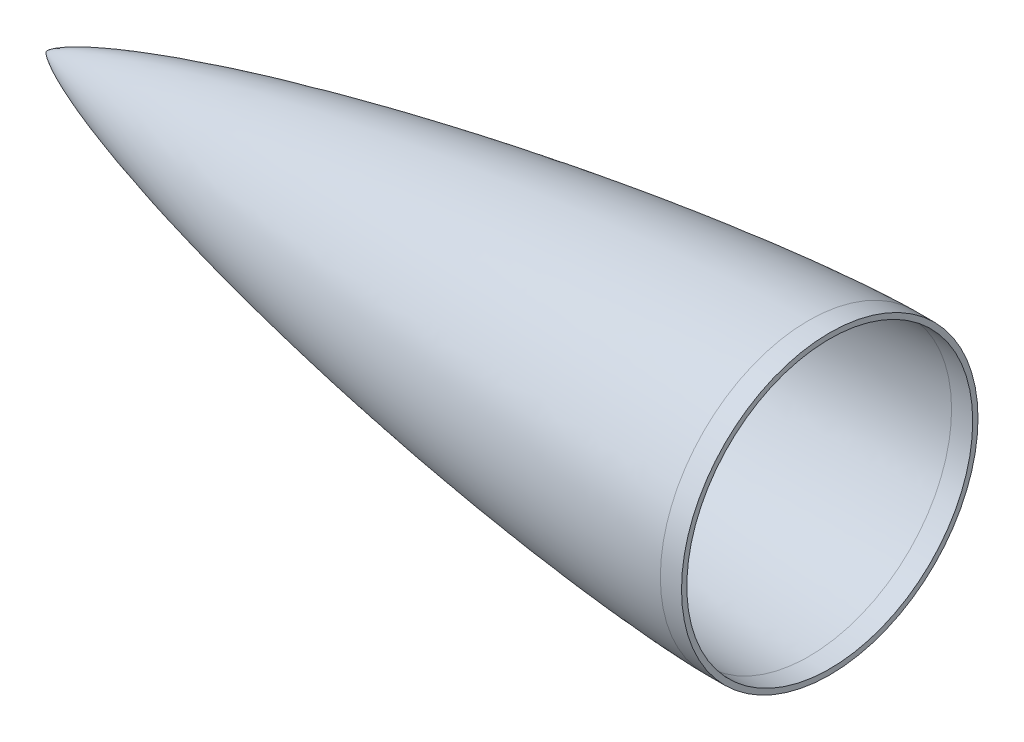
ISO-10303-21;
HEADER;
FILE_DESCRIPTION(('STEP AP214'),'2;1');
FILE_NAME('part.step','',(''),(''),'','','');
FILE_SCHEMA(('AUTOMOTIVE_DESIGN { 1 0 10303 214 1 1 1 1 }'));
ENDSEC;
DATA;
#1=APPLICATION_CONTEXT('core data for automotive mechanical design processes');
#2=APPLICATION_PROTOCOL_DEFINITION('international standard','automotive_design',2000,#1);
#3=PRODUCT_CONTEXT('',#1,'mechanical');
#4=PRODUCT('Part','Part','',(#3));
#5=PRODUCT_RELATED_PRODUCT_CATEGORY('part','',(#4));
#6=PRODUCT_DEFINITION_FORMATION('','',#4);
#7=PRODUCT_DEFINITION_CONTEXT('part definition',#1,'design');
#8=PRODUCT_DEFINITION('design','',#6,#7);
#9=PRODUCT_DEFINITION_SHAPE('','',#8);
#10=(LENGTH_UNIT() NAMED_UNIT(*) SI_UNIT(.MILLI.,.METRE.));
#11=(NAMED_UNIT(*) PLANE_ANGLE_UNIT() SI_UNIT($,.RADIAN.));
#12=(NAMED_UNIT(*) SI_UNIT($,.STERADIAN.) SOLID_ANGLE_UNIT());
#13=UNCERTAINTY_MEASURE_WITH_UNIT(LENGTH_MEASURE(1.E-05),#10,'distance_accuracy_value','');
#14=(GEOMETRIC_REPRESENTATION_CONTEXT(3) GLOBAL_UNCERTAINTY_ASSIGNED_CONTEXT((#13)) GLOBAL_UNIT_ASSIGNED_CONTEXT((#10,
#11,#12)) REPRESENTATION_CONTEXT('',''));
#15=CARTESIAN_POINT('',(0.,0.,0.));
#16=DIRECTION('',(0.,0.,1.));
#17=DIRECTION('',(1.,0.,0.));
#18=AXIS2_PLACEMENT_3D('',#15,#16,#17);
#19=CARTESIAN_POINT('',(457.2,88.9151474306752,0.));
#20=CARTESIAN_POINT('',(455.946325970131,88.9096070595816,0.));
#21=CARTESIAN_POINT('',(453.439259358558,88.8670591141968,0.));
#22=CARTESIAN_POINT('',(448.426238411328,88.7337773947161,0.));
#23=CARTESIAN_POINT('',(439.73839281718,88.3857521285292,0.));
#24=CARTESIAN_POINT('',(428.633298536274,87.7894164542894,0.));
#25=CARTESIAN_POINT('',(411.444893999551,86.6327793707619,0.));
#26=CARTESIAN_POINT('',(389.441443153579,84.7940694843695,0.));
#27=CARTESIAN_POINT('',(363.808737294308,82.2338961157606,0.));
#28=CARTESIAN_POINT('',(334.566457513105,78.8280593272444,0.));
#29=CARTESIAN_POINT('',(305.377643317541,74.992305893388,0.));
#30=CARTESIAN_POINT('',(276.244707872545,70.7535830300126,0.));
#31=CARTESIAN_POINT('',(247.171268660131,66.1243959171367,0.));
#32=CARTESIAN_POINT('',(218.162700889625,61.1047240595085,0.));
#33=CARTESIAN_POINT('',(189.226352810735,55.6834645782928,0.));
#34=CARTESIAN_POINT('',(160.373138085459,49.8354605300759,0.));
#35=CARTESIAN_POINT('',(131.618382458485,43.5190500386218,0.));
#36=CARTESIAN_POINT('',(102.986961257339,36.6637158027097,0.));
#37=CARTESIAN_POINT('',(75.2291315334263,29.34260403624,0.));
#38=CARTESIAN_POINT('',(51.2280847232855,22.2453278220032,0.));
#39=CARTESIAN_POINT('',(32.1609199731866,15.8309473459927,0.));
#40=CARTESIAN_POINT('',(18.8818526621386,10.6607161614939,0.));
#41=CARTESIAN_POINT('',(11.1356400070898,7.19917025164617,0.));
#42=CARTESIAN_POINT('',(6.41553741622741,4.76888097271789,0.));
#43=CARTESIAN_POINT('',(3.70040498934197,3.15649989124108,0.));
#44=CARTESIAN_POINT('',(2.1712436943493,2.11577541374487,0.));
#45=CARTESIAN_POINT('',(1.29726517344645,1.43712408397375,0.));
#46=CARTESIAN_POINT('',(0.796656587163147,0.996403728119644,0.));
#47=CARTESIAN_POINT('',(0.508236086993361,0.709975777371162,0.));
#48=CARTESIAN_POINT('',(0.336940369552542,0.5207345708639,0.));
#49=CARTESIAN_POINT('',(0.219057570584673,0.377905450824387,0.));
#50=CARTESIAN_POINT('',(0.133875618926122,0.263125341051019,0.));
#51=CARTESIAN_POINT('',(0.06950687304492,0.163021890873473,0.));
#52=CARTESIAN_POINT('',(0.025920332395015,0.0786931532777685,0.));
#53=CARTESIAN_POINT('',(0.00817122284619331,0.0346034081490176,0.));
#54=CARTESIAN_POINT('',(0.00225195502300941,0.0116765884656801,0.));
#55=CARTESIAN_POINT('',(0.,0.,0.));
#56=B_SPLINE_CURVE_WITH_KNOTS('',4,(#19,#20,#21,#22,#23,#24,#25,#26,#27,#28,#29,#30,#31,#32,#33,
#34,#35,#36,#37,#38,#39,#40,#41,#42,#43,#44,#45,#46,#47,#48,#49,#50,#51,#52,#53,#54,#55),
.UNSPECIFIED.,.F.,.F.,(5,1,1,1,1,1,1,1,1,1,1,1,1,1,1,1,1,1,1,1,1,1,1,1,1,1,1,1,1,1,1,1,1,5),(0.,
0.0107028585408144,0.0214057170816288,0.0428114341632575,0.0742270157557156,0.105642597348174,
0.168473764273532,0.231304932082114,0.294136099101199,0.356967264511137,0.419798428516133,
0.482629593130158,0.54546076349562,0.608291924387174,0.671123088525779,0.733954252495489,
0.796785426569319,0.859616580073358,0.916172283638337,0.947587760918424,0.968473522471574,
0.981230284106354,0.988574031772078,0.992887341044273,0.995416079253204,0.997012129469831,
0.998014752370499,0.998578001550583,0.998884285300425,0.999190569050268,0.999595284525134,
0.999797642262567,0.999898821131283,1.),.UNSPECIFIED.);
#57=CARTESIAN_POINT('',(457.2,0.,0.));
#58=DIRECTION('',(1.,0.,0.));
#59=AXIS1_PLACEMENT('',#57,#58);
#60=SURFACE_OF_REVOLUTION('',#56,#59);
#61=CARTESIAN_POINT('',(0.,0.,0.));
#62=VERTEX_POINT('',#61);
#63=VERTEX_LOOP('',#62);
#64=FACE_BOUND('',#63,.T.);
#65=CARTESIAN_POINT('',(457.2,0.,0.));
#66=DIRECTION('',(1.,0.,0.));
#67=DIRECTION('',(0.,0.,-1.));
#68=AXIS2_PLACEMENT_3D('',#65,#66,#67);
#69=CIRCLE('',#68,88.9151474306748);
#70=CARTESIAN_POINT('',(457.2,0.,-88.9151474306748));
#71=VERTEX_POINT('',#70);
#72=EDGE_CURVE('E43',#71,#71,#69,.T.);
#73=ORIENTED_EDGE('',*,*,#72,.F.);
#74=EDGE_LOOP('',(#73));
#75=FACE_BOUND('',#74,.T.);
#76=ADVANCED_FACE('F35',(#64,#75),#60,.F.);
#77=CARTESIAN_POINT('',(469.9,0.,0.));
#78=DIRECTION('',(1.,0.,0.));
#79=DIRECTION('',(0.,0.,-1.));
#80=AXIS2_PLACEMENT_3D('',#77,#78,#79);
#81=PLANE('',#80);
#82=CARTESIAN_POINT('',(469.9,0.,0.));
#83=DIRECTION('',(1.,0.,0.));
#84=DIRECTION('',(0.,0.,-1.));
#85=AXIS2_PLACEMENT_3D('',#82,#83,#84);
#86=CIRCLE('',#85,85.7401474306751);
#87=CARTESIAN_POINT('',(469.9,0.,-85.7401474306751));
#88=VERTEX_POINT('',#87);
#89=EDGE_CURVE('E61',#88,#88,#86,.T.);
#90=ORIENTED_EDGE('',*,*,#89,.F.);
#91=EDGE_LOOP('',(#90));
#92=FACE_BOUND('',#91,.T.);
#93=CARTESIAN_POINT('',(469.9,0.,0.));
#94=DIRECTION('',(1.,0.,0.));
#95=DIRECTION('',(0.,0.,-1.));
#96=AXIS2_PLACEMENT_3D('',#93,#94,#95);
#97=CIRCLE('',#96,88.9151474306753);
#98=CARTESIAN_POINT('',(469.9,0.,-88.9151474306753));
#99=VERTEX_POINT('',#98);
#100=EDGE_CURVE('E11',#99,#99,#97,.T.);
#101=ORIENTED_EDGE('',*,*,#100,.T.);
#102=EDGE_LOOP('',(#101));
#103=FACE_BOUND('',#102,.T.);
#104=ADVANCED_FACE('F85',(#92,#103),#81,.T.);
#105=CARTESIAN_POINT('',(457.2,0.,0.));
#106=DIRECTION('',(1.,0.,0.));
#107=DIRECTION('',(0.,0.,-1.));
#108=AXIS2_PLACEMENT_3D('',#105,#106,#107);
#109=CYLINDRICAL_SURFACE('',#108,88.9151474306751);
#110=ORIENTED_EDGE('',*,*,#72,.T.);
#111=EDGE_LOOP('',(#110));
#112=FACE_BOUND('',#111,.T.);
#113=ORIENTED_EDGE('',*,*,#100,.F.);
#114=EDGE_LOOP('',(#113));
#115=FACE_BOUND('',#114,.T.);
#116=ADVANCED_FACE('F53',(#112,#115),#109,.T.);
#117=CARTESIAN_POINT('',(457.2,88.9151474306752,0.));
#118=CARTESIAN_POINT('',(455.946325970131,88.9096070595816,0.));
#119=CARTESIAN_POINT('',(453.439259358558,88.8670591141968,0.));
#120=CARTESIAN_POINT('',(448.426238411328,88.7337773947161,0.));
#121=CARTESIAN_POINT('',(439.73839281718,88.3857521285292,0.));
#122=CARTESIAN_POINT('',(428.633298536274,87.7894164542894,0.));
#123=CARTESIAN_POINT('',(411.444893999551,86.6327793707619,0.));
#124=CARTESIAN_POINT('',(389.441443153579,84.7940694843695,0.));
#125=CARTESIAN_POINT('',(363.808737294308,82.2338961157606,0.));
#126=CARTESIAN_POINT('',(334.566457513105,78.8280593272444,0.));
#127=CARTESIAN_POINT('',(305.377643317541,74.992305893388,0.));
#128=CARTESIAN_POINT('',(276.244707872545,70.7535830300126,0.));
#129=CARTESIAN_POINT('',(247.171268660131,66.1243959171367,0.));
#130=CARTESIAN_POINT('',(218.162700889625,61.1047240595085,0.));
#131=CARTESIAN_POINT('',(189.226352810735,55.6834645782928,0.));
#132=CARTESIAN_POINT('',(160.373138085459,49.8354605300759,0.));
#133=CARTESIAN_POINT('',(131.618382458485,43.5190500386218,0.));
#134=CARTESIAN_POINT('',(102.986961257339,36.6637158027097,0.));
#135=CARTESIAN_POINT('',(75.2291315334263,29.34260403624,0.));
#136=CARTESIAN_POINT('',(51.2280847232855,22.2453278220032,0.));
#137=CARTESIAN_POINT('',(32.1609199731866,15.8309473459927,0.));
#138=CARTESIAN_POINT('',(18.8818526621386,10.6607161614939,0.));
#139=CARTESIAN_POINT('',(11.1356400070898,7.19917025164617,0.));
#140=CARTESIAN_POINT('',(6.56443195126468,4.84554388103954,0.));
#141=CARTESIAN_POINT('',(4.24353193294884,3.47834755188173,0.));
#142=CARTESIAN_POINT('',(3.23765947503868,2.82723498943833,0.));
#143=CARTESIAN_POINT('',(2.95679087341137,2.63945943168812,0.));
#144=B_SPLINE_CURVE_WITH_KNOTS('',4,(#117,#118,#119,#120,#121,#122,#123,#124,#125,#126,#127,
#128,#129,#130,#131,#132,#133,#134,#135,#136,#137,#138,#139,#140,#141,#142,#143),.UNSPECIFIED.,
.F.,.F.,(5,1,1,1,1,1,1,1,1,1,1,1,1,1,1,1,1,1,1,1,1,1,1,5),(0.,0.0107028585408144,
0.0214057170816288,0.0428114341632575,0.0742270157557156,0.105642597348174,0.168473764273532,
0.231304932082114,0.294136099101199,0.356967264511137,0.419798428516133,0.482629593130158,
0.54546076349562,0.608291924387174,0.671123088525779,0.733954252495489,0.796785426569319,
0.859616580073358,0.916172283638337,0.947587760918424,0.968473522471574,0.981230284106354,
0.988574031772078,0.991458376357514),.UNSPECIFIED.);
#145=CARTESIAN_POINT('',(457.2,0.,0.));
#146=DIRECTION('',(1.,0.,0.));
#147=AXIS1_PLACEMENT('',#145,#146);
#148=SURFACE_OF_REVOLUTION('',#144,#147);
#149=OFFSET_SURFACE('',#148,3.175,.F.);
#150=CARTESIAN_POINT('',(4.72140950316467,0.,0.));
#151=VERTEX_POINT('',#150);
#152=VERTEX_LOOP('',#151);
#153=FACE_BOUND('',#152,.T.);
#154=CARTESIAN_POINT('',(457.214031164219,0.,-85.7401784345383));
#155=CARTESIAN_POINT('',(457.214031164152,1.40292180575902,-85.7402081939915));
#156=CARTESIAN_POINT('',(457.214031164156,2.80584107928027,-85.7057466471904));
#157=CARTESIAN_POINT('',(457.214031164201,5.60830122533601,-85.5680546220737));
#158=CARTESIAN_POINT('',(457.214031164242,7.00784209787054,-85.4648241437591));
#159=CARTESIAN_POINT('',(457.214031164254,9.8001721053742,-85.1898079366197));
#160=CARTESIAN_POINT('',(457.214031164225,11.1929612403438,-85.0180222078003));
#161=CARTESIAN_POINT('',(457.214031164187,13.9684328828145,-84.6063187274703));
#162=CARTESIAN_POINT('',(457.214031164177,15.3511153903144,-84.3664009759524));
#163=CARTESIAN_POINT('',(457.214031164188,18.1030426508934,-83.819008919495));
#164=CARTESIAN_POINT('',(457.214031164207,19.4722874039728,-83.5115346145577));
#165=CARTESIAN_POINT('',(457.214031164205,22.1940405581952,-82.8297708573391));
#166=CARTESIAN_POINT('',(457.214031164183,23.5465489593396,-82.455481405063));
#167=CARTESIAN_POINT('',(457.214031164191,26.2315710898439,-81.6409888687209));
#168=CARTESIAN_POINT('',(457.21403116422,27.5640848192022,-81.2007857846493));
#169=CARTESIAN_POINT('',(457.214031164236,30.2059074660631,-80.2555265208975));
#170=CARTESIAN_POINT('',(457.214031164222,31.5152163835665,-79.7504703412193));
#171=CARTESIAN_POINT('',(457.214031164207,34.1074751662925,-78.6767215978475));
#172=CARTESIAN_POINT('',(457.214031164205,35.3904250315145,-78.1080290341522));
#173=CARTESIAN_POINT('',(457.214031164213,37.9268749711856,-76.9083775564403));
#174=CARTESIAN_POINT('',(457.214031164222,39.1803750456353,-76.2774186424251));
#175=CARTESIAN_POINT('',(457.214031164226,41.6549056122618,-74.9547544984277));
#176=CARTESIAN_POINT('',(457.214031164222,42.875936104439,-74.2630492684461));
#177=CARTESIAN_POINT('',(457.214031164224,45.2825859371492,-72.8205588712398));
#178=CARTESIAN_POINT('',(457.21403116423,46.4682052776819,-72.0697737040148));
#179=CARTESIAN_POINT('',(457.214031164238,48.801176546257,-70.5109321394844));
#180=CARTESIAN_POINT('',(457.21403116424,49.9485284742991,-69.7028757421787));
#181=CARTESIAN_POINT('',(457.214031164227,52.2022008466007,-68.031438396144));
#182=CARTESIAN_POINT('',(457.214031164211,53.3085212908599,-67.1680574474147));
#183=CARTESIAN_POINT('',(457.214031164204,55.4774654727964,-65.3880509588123));
#184=CARTESIAN_POINT('',(457.214031164213,56.5400892104713,-64.4714254189364));
#185=CARTESIAN_POINT('',(457.214031164226,58.6190800254749,-62.587137979335));
#186=CARTESIAN_POINT('',(457.21403116423,59.6354471028056,-61.6194760796117));
#187=CARTESIAN_POINT('',(457.214031164225,61.6194760798162,-59.635447102593));
#188=CARTESIAN_POINT('',(457.214031164215,62.587137979498,-58.6190800252996));
#189=CARTESIAN_POINT('',(457.214031164224,64.4714254189735,-56.5400892104259));
#190=CARTESIAN_POINT('',(457.214031164242,65.3880509587675,-55.477465472846));
#191=CARTESIAN_POINT('',(457.214031164246,67.168057447352,-53.3085212909419));
#192=CARTESIAN_POINT('',(457.214031164234,68.0314383961372,-52.2022008466134));
#193=CARTESIAN_POINT('',(457.214031164234,69.7028757422058,-49.948528474259));
#194=CARTESIAN_POINT('',(457.214031164246,70.5109321394939,-48.8011765462365));
#195=CARTESIAN_POINT('',(457.214031164222,72.0697737040188,-46.4682052776822));
#196=CARTESIAN_POINT('',(457.214031164185,72.8205588712549,-45.2825859371499));
#197=CARTESIAN_POINT('',(457.21403116418,74.2630492684307,-42.8759361044382));
#198=CARTESIAN_POINT('',(457.214031164213,74.9547544983708,-41.6549056122591));
#199=CARTESIAN_POINT('',(457.214031164235,76.2774186424902,-39.1803750456226));
#200=CARTESIAN_POINT('',(457.214031164225,76.9083775566681,-37.9268749711645));
#201=CARTESIAN_POINT('',(457.214031164214,78.1080290339546,-35.390425031472));
#202=CARTESIAN_POINT('',(457.214031164212,78.6767215970634,-34.1074751662375));
#203=CARTESIAN_POINT('',(457.214031164216,79.7504703420046,-31.5152163836184));
#204=CARTESIAN_POINT('',(457.214031164221,80.2555265238385,-30.2059074662343));
#205=CARTESIAN_POINT('',(457.214031164234,81.2007857816874,-27.5640848190895));
#206=CARTESIAN_POINT('',(457.214031164242,81.6409888576994,-26.2315710893277));
#207=CARTESIAN_POINT('',(457.214031164229,82.4554814160957,-23.5465489598204));
#208=CARTESIAN_POINT('',(457.214031164207,82.829770898482,-22.1940405600756));
#209=CARTESIAN_POINT('',(457.214031164206,83.5115345734853,-19.4722874018107));
#210=CARTESIAN_POINT('',(457.214031164227,83.8190087661047,-18.1030426432913));
#211=CARTESIAN_POINT('',(457.21403116423,84.3664011293389,-15.3511153979372));
#212=CARTESIAN_POINT('',(457.214031164211,84.6063192999514,-13.9684329111021));
#213=CARTESIAN_POINT('',(457.2140311642,85.0180216352834,-11.1929612122972));
#214=CARTESIAN_POINT('',(457.214031164208,85.1898057999989,-9.80017200032687));
#215=CARTESIAN_POINT('',(457.214031164194,85.4648262804035,-7.00784220267474));
#216=CARTESIAN_POINT('',(457.214031164171,85.5680625960991,-5.60830161699361));
#217=CARTESIAN_POINT('',(457.214031164186,85.705738673169,-2.80584068754182));
#218=CARTESIAN_POINT('',(457.214031164223,85.7401784345383,-1.40292034377093));
#219=CARTESIAN_POINT('',(457.214031164216,85.7401784345383,1.40292034377059));
#220=CARTESIAN_POINT('',(457.214031164173,85.705738673169,2.80584068754121));
#221=CARTESIAN_POINT('',(457.214031164185,85.5680625960952,5.60830161707506));
#222=CARTESIAN_POINT('',(457.214031164241,85.4648262803916,7.00784220283834));
#223=CARTESIAN_POINT('',(457.214031164255,85.1898057999872,9.80017200040711));
#224=CARTESIAN_POINT('',(457.214031164214,85.0180216352918,11.1929612122132));
#225=CARTESIAN_POINT('',(457.214031164198,84.6063192999911,13.9684329108618));
#226=CARTESIAN_POINT('',(457.214031164224,84.3664011293815,15.3511153977037));
#227=CARTESIAN_POINT('',(457.214031164233,83.8190087661229,18.1030426432196));
#228=CARTESIAN_POINT('',(457.214031164216,83.511534573469,19.4722874018924));
#229=CARTESIAN_POINT('',(457.214031164197,82.8297708984407,22.1940405602243));
#230=CARTESIAN_POINT('',(457.214031164196,82.4554814160754,23.5465489598856));
#231=CARTESIAN_POINT('',(457.214031164185,81.6409888577049,26.2315710893096));
#232=CARTESIAN_POINT('',(457.214031164174,81.2007857816935,27.5640848190705));
#233=CARTESIAN_POINT('',(457.214031164185,80.2555265238434,30.2059074662212));
#234=CARTESIAN_POINT('',(457.214031164208,79.7504703420073,31.5152163836119));
#235=CARTESIAN_POINT('',(457.21403116422,78.6767215970635,34.1074751662374));
#236=CARTESIAN_POINT('',(457.21403116421,78.1080290339547,35.3904250314718));
#237=CARTESIAN_POINT('',(457.214031164208,76.9083775566764,37.9268749711467));
#238=CARTESIAN_POINT('',(457.214031164216,76.2774186425078,39.1803750455876));
#239=CARTESIAN_POINT('',(457.214031164232,74.9547544983902,41.6549056122251));
#240=CARTESIAN_POINT('',(457.21403116424,74.263049268441,42.8759361044215));
#241=CARTESIAN_POINT('',(457.21403116423,72.8205588712315,45.2825859371893));
#242=CARTESIAN_POINT('',(457.21403116421,72.0697737039697,46.4682052777596));
#243=CARTESIAN_POINT('',(457.214031164179,70.5109321394177,48.801176546346));
#244=CARTESIAN_POINT('',(457.214031164168,69.7028757421303,49.9485284743638));
#245=CARTESIAN_POINT('',(457.214031164196,68.0314383961463,52.2022008465974));
#246=CARTESIAN_POINT('',(457.214031164237,67.1680574474506,53.3085212908139));
#247=CARTESIAN_POINT('',(457.214031164251,65.3880509589567,55.4774654726234));
#248=CARTESIAN_POINT('',(457.214031164226,64.4714254191579,56.5400892102159));
#249=CARTESIAN_POINT('',(457.214031164214,62.5871379795815,58.619080025214));
#250=CARTESIAN_POINT('',(457.214031164226,61.6194760797985,59.6354471026148));
#251=CARTESIAN_POINT('',(457.214031164228,59.635447102658,61.6194760797552));
#252=CARTESIAN_POINT('',(457.214031164217,58.6190800253027,62.587137979497));
#253=CARTESIAN_POINT('',(457.214031164223,56.5400892103365,64.4714254190526));
#254=CARTESIAN_POINT('',(457.214031164241,55.4774654727277,65.3880509588686));
#255=CARTESIAN_POINT('',(457.214031164247,53.3085212908924,67.1680574473886));
#256=CARTESIAN_POINT('',(457.214031164237,52.2022008466666,68.0314383960937));
#257=CARTESIAN_POINT('',(457.214031164231,49.9485284743674,69.7028757421295));
#258=CARTESIAN_POINT('',(457.214031164235,48.8011765462916,70.510932139457));
#259=CARTESIAN_POINT('',(457.214031164232,46.4682052776646,72.0697737040306));
#260=CARTESIAN_POINT('',(457.214031164224,45.2825859371142,72.8205588712777));
#261=CARTESIAN_POINT('',(457.214031164221,42.8759361043848,74.2630492684617));
#262=CARTESIAN_POINT('',(457.214031164226,41.6549056122065,74.9547544984));
#263=CARTESIAN_POINT('',(457.214031164222,39.1803750455878,76.2774186425077));
#264=CARTESIAN_POINT('',(457.214031164213,37.9268749711469,76.9083775566763));
#265=CARTESIAN_POINT('',(457.214031164206,35.390425031472,78.1080290339546));
#266=CARTESIAN_POINT('',(457.214031164208,34.1074751662375,78.6767215970634));
#267=CARTESIAN_POINT('',(457.21403116422,31.5152163836184,79.7504703420047));
#268=CARTESIAN_POINT('',(457.214031164231,30.2059074662343,80.2555265238385));
#269=CARTESIAN_POINT('',(457.214031164217,27.5640848190782,81.2007857816914));
#270=CARTESIAN_POINT('',(457.214031164193,26.231571089305,81.6409888577067));
#271=CARTESIAN_POINT('',(457.214031164181,23.5465489598741,82.4554814160785));
#272=CARTESIAN_POINT('',(457.214031164194,22.1940405602187,82.829770898442));
#273=CARTESIAN_POINT('',(457.214031164219,19.4722874019634,83.5115345734512));
#274=CARTESIAN_POINT('',(457.21403116423,18.1030426433621,83.8190087660909));
#275=CARTESIAN_POINT('',(457.214031164227,15.3511153978507,84.3664011293559));
#276=CARTESIAN_POINT('',(457.214031164213,13.9684329109401,84.6063192999794));
#277=CARTESIAN_POINT('',(457.214031164197,11.192961212137,85.0180216353032));
#278=CARTESIAN_POINT('',(457.214031164195,9.80017200024503,85.189805800007));
#279=CARTESIAN_POINT('',(457.214031164207,7.0078422025906,85.4648262804117));
#280=CARTESIAN_POINT('',(457.214031164219,5.60830161682807,85.5680625961115));
#281=CARTESIAN_POINT('',(457.214031164232,2.80584068737689,85.7057386731733));
#282=CARTESIAN_POINT('',(457.214031164232,1.4029203436884,85.7401784345384));
#283=CARTESIAN_POINT('',(457.214031164207,-1.40292034377093,85.7401784345382));
#284=CARTESIAN_POINT('',(457.214031164182,-2.80584068754178,85.705738673169));
#285=CARTESIAN_POINT('',(457.214031164175,-5.60830161699352,85.5680625960991));
#286=CARTESIAN_POINT('',(457.214031164191,-7.00784220267466,85.4648262804034));
#287=CARTESIAN_POINT('',(457.21403116421,-9.80017200024699,85.1898058000068));
#288=CARTESIAN_POINT('',(457.214031164213,-11.1929612121379,85.0180216353032));
#289=CARTESIAN_POINT('',(457.214031164199,-13.9684329109439,84.6063192999788));
#290=CARTESIAN_POINT('',(457.214031164183,-15.3511153978585,84.3664011293543));
#291=CARTESIAN_POINT('',(457.214031164181,-18.1030426433649,83.8190087660899));
#292=CARTESIAN_POINT('',(457.214031164194,-19.4722874019572,83.5115345734524));
#293=CARTESIAN_POINT('',(457.214031164219,-22.1940405602853,82.8297708984257));
#294=CARTESIAN_POINT('',(457.21403116423,-23.5465489600214,82.4554814160381));
#295=CARTESIAN_POINT('',(457.214031164235,-26.2315710894482,81.6409888576594));
#296=CARTESIAN_POINT('',(457.214031164229,-27.5640848191392,81.2007857816692));
#297=CARTESIAN_POINT('',(457.214031164219,-30.2059074662781,80.2555265238232));
#298=CARTESIAN_POINT('',(457.214031164214,-31.5152163837247,79.7504703419638));
#299=CARTESIAN_POINT('',(457.214031164214,-34.107475166348,78.6767215970145));
#300=CARTESIAN_POINT('',(457.214031164217,-35.3904250315265,78.1080290339288));
#301=CARTESIAN_POINT('',(457.214031164221,-37.9268749711468,76.9083775566764));
#302=CARTESIAN_POINT('',(457.214031164221,-39.1803750455876,76.2774186425078));
#303=CARTESIAN_POINT('',(457.214031164226,-41.6549056122064,74.9547544984001));
#304=CARTESIAN_POINT('',(457.214031164231,-42.8759361043846,74.2630492684618));
#305=CARTESIAN_POINT('',(457.214031164215,-45.2825859371338,72.8205588712659));
#306=CARTESIAN_POINT('',(457.214031164193,-46.4682052777032,72.069773704006));
#307=CARTESIAN_POINT('',(457.214031164196,-48.8011765464046,70.51093213938));
#308=CARTESIAN_POINT('',(457.21403116422,-49.9485284745346,69.702875742011));
#309=CARTESIAN_POINT('',(457.214031164247,-52.2022008467891,68.0314383959974));
#310=CARTESIAN_POINT('',(457.21403116425,-53.3085212909213,67.1680574473632));
#311=CARTESIAN_POINT('',(457.214031164238,-55.477465472688,65.3880509589028));
#312=CARTESIAN_POINT('',(457.214031164222,-56.5400892103171,64.4714254190702));
#313=CARTESIAN_POINT('',(457.214031164217,-58.619080025346,62.5871379794578));
#314=CARTESIAN_POINT('',(457.214031164228,-59.6354471027426,61.6194760796747));
#315=CARTESIAN_POINT('',(457.214031164227,-61.6194760798357,59.6354471025735));
#316=CARTESIAN_POINT('',(457.214031164215,-62.5871379795362,58.6190800252595));
#317=CARTESIAN_POINT('',(457.214031164224,-64.4714254190526,56.5400892103366));
#318=CARTESIAN_POINT('',(457.214031164244,-65.3880509588686,55.4774654727278));
#319=CARTESIAN_POINT('',(457.214031164244,-67.1680574474042,53.3085212908734));
#320=CARTESIAN_POINT('',(457.214031164223,-68.0314383961239,52.2022008466279));
#321=CARTESIAN_POINT('',(457.214031164217,-69.702875742144,49.9485284743456));
#322=CARTESIAN_POINT('',(457.214031164232,-70.5109321394442,48.8011765463087));
#323=CARTESIAN_POINT('',(457.214031164236,-72.0697737040061,46.4682052777034));
#324=CARTESIAN_POINT('',(457.214031164225,-72.8205588712659,45.2825859371339));
#325=CARTESIAN_POINT('',(457.21403116422,-74.2630492684617,42.8759361043847));
#326=CARTESIAN_POINT('',(457.214031164226,-74.9547544984001,41.6549056122065));
#327=CARTESIAN_POINT('',(457.214031164222,-76.2774186424994,39.1803750456033));
#328=CARTESIAN_POINT('',(457.214031164212,-76.9083775566605,37.9268749711784));
#329=CARTESIAN_POINT('',(457.214031164207,-78.1080290339077,35.3904250315732));
#330=CARTESIAN_POINT('',(457.214031164211,-78.6767215969949,34.1074751663933));
#331=CARTESIAN_POINT('',(457.214031164217,-79.7504703419471,31.5152163837672));
#332=CARTESIAN_POINT('',(457.214031164218,-80.2555265238078,30.2059074663191));
#333=CARTESIAN_POINT('',(457.21403116423,-81.200785781685,27.564084819097));
#334=CARTESIAN_POINT('',(457.214031164241,-81.6409888577011,26.231571089323));
#335=CARTESIAN_POINT('',(457.21403116423,-82.4554814160974,23.5465489598137));
#336=CARTESIAN_POINT('',(457.214031164207,-82.8297708984808,22.1940405600795));
#337=CARTESIAN_POINT('',(457.214031164206,-83.5115345735028,19.472287401742));
#338=CARTESIAN_POINT('',(457.214031164227,-83.8190087661393,18.1030426431381));
#339=CARTESIAN_POINT('',(457.21403116423,-84.3664011293825,15.3511153976974));
#340=CARTESIAN_POINT('',(457.214031164212,-84.6063192999912,13.9684329108609));
#341=CARTESIAN_POINT('',(457.2140311642,-85.0180216353035,11.192961212135));
#342=CARTESIAN_POINT('',(457.214031164207,-85.1898058000069,9.80017200024558));
#343=CARTESIAN_POINT('',(457.214031164195,-85.4648262804035,7.00784220267451));
#344=CARTESIAN_POINT('',(457.214031164175,-85.5680625960992,5.60830161699312));
#345=CARTESIAN_POINT('',(457.214031164182,-85.705738673169,2.80584068754138));
#346=CARTESIAN_POINT('',(457.21403116421,-85.7401784345383,1.40292034377079));
#347=CARTESIAN_POINT('',(457.214031164228,-85.7401784345383,-1.40292034377078));
#348=CARTESIAN_POINT('',(457.214031164219,-85.7057386731692,-2.80584068754177));
#349=CARTESIAN_POINT('',(457.214031164232,-85.5680625960954,-5.60830161707567));
#350=CARTESIAN_POINT('',(457.214031164253,-85.4648262803916,-7.00784220283862));
#351=CARTESIAN_POINT('',(457.214031164242,-85.1898057999791,-9.80017200048845));
#352=CARTESIAN_POINT('',(457.21403116421,-85.0180216352718,-11.1929612123755));
#353=CARTESIAN_POINT('',(457.214031164202,-84.6063192999638,-13.9684329110189));
#354=CARTESIAN_POINT('',(457.214031164227,-84.3664011293669,-15.351115397776));
#355=CARTESIAN_POINT('',(457.214031164229,-83.8190087661403,-18.1030426431331));
#356=CARTESIAN_POINT('',(457.214031164207,-83.511534573505,-19.4722874017321));
#357=CARTESIAN_POINT('',(457.214031164207,-82.8297708984749,-22.194040560104));
#358=CARTESIAN_POINT('',(457.21403116423,-82.4554814160801,-23.5465489598768));
#359=CARTESIAN_POINT('',(457.214031164241,-81.6409888576675,-26.2315710894281));
#360=CARTESIAN_POINT('',(457.21403116423,-81.2007857816481,-27.5640848192061));
#361=CARTESIAN_POINT('',(457.214031164218,-80.2555265237868,-30.2059074663719));
#362=CARTESIAN_POINT('',(457.214031164217,-79.7504703419484,-31.515216383761));
#363=CARTESIAN_POINT('',(457.214031164211,-78.6767215970509,-34.1074751662611));
#364=CARTESIAN_POINT('',(457.214031164207,-78.1080290339966,-35.390425031374));
#365=CARTESIAN_POINT('',(457.214031164212,-76.9083775567495,-37.9268749710013));
#366=CARTESIAN_POINT('',(457.214031164221,-76.2774186425482,-39.1803750455117));
#367=CARTESIAN_POINT('',(457.214031164226,-74.9547544983703,-41.6549056122626));
#368=CARTESIAN_POINT('',(457.214031164222,-74.2630492683944,-42.8759361045037));
#369=CARTESIAN_POINT('',(457.214031164224,-72.8205588712018,-45.2825859372341));
#370=CARTESIAN_POINT('',(457.21403116423,-72.0697737039896,-46.4682052777261));
#371=CARTESIAN_POINT('',(457.214031164212,-70.5109321394281,-48.8011765463345));
#372=CARTESIAN_POINT('',(457.214031164187,-69.702875742073,-49.948528474447));
#373=CARTESIAN_POINT('',(457.214031164205,-68.031438396021,-52.2022008467605));
#374=CARTESIAN_POINT('',(457.214031164247,-67.1680574473298,-53.3085212909658));
#375=CARTESIAN_POINT('',(457.21403116424,-65.3880509588049,-55.4774654728035));
#376=CARTESIAN_POINT('',(457.214031164191,-64.4714254189682,-56.5400892104334));
#377=CARTESIAN_POINT('',(457.214031164179,-62.5871379794242,-58.6190800253789));
#378=CARTESIAN_POINT('',(457.214031164216,-61.6194760797179,-59.6354471026953));
#379=CARTESIAN_POINT('',(457.214031164238,-59.6354471026954,-61.6194760797179));
#380=CARTESIAN_POINT('',(457.214031164223,-58.6190800253792,-62.5871379794242));
#381=CARTESIAN_POINT('',(457.214031164216,-56.5400892104336,-64.4714254189682));
#382=CARTESIAN_POINT('',(457.214031164225,-55.4774654728035,-65.3880509588052));
#383=CARTESIAN_POINT('',(457.214031164233,-53.3085212909657,-67.1680574473295));
#384=CARTESIAN_POINT('',(457.214031164233,-52.2022008467606,-68.0314383960199));
#385=CARTESIAN_POINT('',(457.214031164234,-49.9485284744841,-69.702875742047));
#386=CARTESIAN_POINT('',(457.214031164236,-48.8011765464097,-70.5109321393795));
#387=CARTESIAN_POINT('',(457.214031164231,-46.4682052777856,-72.0697737039483));
#388=CARTESIAN_POINT('',(457.214031164224,-45.2825859372368,-72.8205588711858));
#389=CARTESIAN_POINT('',(457.214031164222,-42.8759361044678,-74.2630492684304));
#390=CARTESIAN_POINT('',(457.214031164226,-41.6549056122471,-74.9547544984368));
#391=CARTESIAN_POINT('',(457.214031164222,-39.1803750455752,-76.277418642456));
#392=CARTESIAN_POINT('',(457.214031164213,-37.9268749711247,-76.9083775564703));
#393=CARTESIAN_POINT('',(457.214031164206,-35.390425031438,-78.1080290341872));
#394=CARTESIAN_POINT('',(457.214031164208,-34.1074751662007,-78.6767215978876));
#395=CARTESIAN_POINT('',(457.21403116422,-31.515216383485,-79.750470341251));
#396=CARTESIAN_POINT('',(457.21403116423,-30.2059074660081,-80.2555265209177));
#397=CARTESIAN_POINT('',(457.214031164218,-27.5640848192279,-81.2007857846396));
#398=CARTESIAN_POINT('',(457.214031164196,-26.2315710899243,-81.6409888686941));
#399=CARTESIAN_POINT('',(457.214031164185,-23.5465489594029,-82.4554814050462));
#400=CARTESIAN_POINT('',(457.214031164195,-22.1940405581849,-82.8297708573431));
#401=CARTESIAN_POINT('',(457.214031164218,-19.4722874038746,-83.5115346145808));
#402=CARTESIAN_POINT('',(457.21403116423,-18.1030426507819,-83.8190089195195));
#403=CARTESIAN_POINT('',(457.214031164227,-15.3511153903379,-84.3664009759458));
#404=CARTESIAN_POINT('',(457.214031164211,-13.9684328829879,-84.6063187274393));
#405=CARTESIAN_POINT('',(457.214031164201,-11.1929612404991,-85.0180222077826));
#406=CARTESIAN_POINT('',(457.214031164206,-9.80017210535915,-85.1898079366241));
#407=CARTESIAN_POINT('',(457.214031164196,-7.00784209767349,-85.4648241437752));
#408=CARTESIAN_POINT('',(457.214031164182,-5.60830122512807,-85.5680546220875));
#409=CARTESIAN_POINT('',(457.214031164175,-2.80584107913435,-85.7057466471941));
#410=CARTESIAN_POINT('',(457.214031164182,-1.4029218056862,-85.7402081939916));
#411=CARTESIAN_POINT('',(457.214031164219,-2.17834338147942E-13,-85.7401784345383));
#412=B_SPLINE_CURVE_WITH_KNOTS('',3,(#154,#155,#156,#157,#158,#159,#160,#161,#162,#163,#164,
#165,#166,#167,#168,#169,#170,#171,#172,#173,#174,#175,#176,#177,#178,#179,#180,#181,#182,#183,
#184,#185,#186,#187,#188,#189,#190,#191,#192,#193,#194,#195,#196,#197,#198,#199,#200,#201,#202,
#203,#204,#205,#206,#207,#208,#209,#210,#211,#212,#213,#214,#215,#216,#217,#218,#219,#220,#221,
#222,#223,#224,#225,#226,#227,#228,#229,#230,#231,#232,#233,#234,#235,#236,#237,#238,#239,#240,
#241,#242,#243,#244,#245,#246,#247,#248,#249,#250,#251,#252,#253,#254,#255,#256,#257,#258,#259,
#260,#261,#262,#263,#264,#265,#266,#267,#268,#269,#270,#271,#272,#273,#274,#275,#276,#277,#278,
#279,#280,#281,#282,#283,#284,#285,#286,#287,#288,#289,#290,#291,#292,#293,#294,#295,#296,#297,
#298,#299,#300,#301,#302,#303,#304,#305,#306,#307,#308,#309,#310,#311,#312,#313,#314,#315,#316,
#317,#318,#319,#320,#321,#322,#323,#324,#325,#326,#327,#328,#329,#330,#331,#332,#333,#334,#335,
#336,#337,#338,#339,#340,#341,#342,#343,#344,#345,#346,#347,#348,#349,#350,#351,#352,#353,#354,
#355,#356,#357,#358,#359,#360,#361,#362,#363,#364,#365,#366,#367,#368,#369,#370,#371,#372,#373,
#374,#375,#376,#377,#378,#379,#380,#381,#382,#383,#384,#385,#386,#387,#388,#389,#390,#391,#392,
#393,#394,#395,#396,#397,#398,#399,#400,#401,#402,#403,#404,#405,#406,#407,#408,#409,#410,#411),
.UNSPECIFIED.,.F.,.F.,(4,2,2,2,2,2,2,2,2,2,2,2,2,2,2,2,2,2,2,2,2,2,2,2,2,2,2,2,2,2,2,2,2,2,2,2,
2,2,2,2,2,2,2,2,2,2,2,2,2,2,2,2,2,2,2,2,2,2,2,2,2,2,2,2,2,2,2,2,2,2,2,2,2,2,2,2,2,2,2,2,2,2,2,2,
2,2,2,2,2,2,2,2,2,2,2,2,2,2,2,2,2,2,2,2,2,2,2,2,2,2,2,2,2,2,2,2,2,2,2,2,2,2,2,2,2,2,2,2,4),(0.,
4.20833862523187,8.41667725040577,12.6250158752592,16.8333545005713,21.0416931257527,
25.2500317506089,29.4583703758219,33.6667090009041,37.875047626094,42.0833862511848,
46.2917248762336,50.5000635013123,54.7084021264103,58.9167407515211,63.1250793768525,
67.3334180020082,71.5417566269971,75.7500952519531,79.9584338773292,84.1667725023536,
88.3751111274323,92.583449752481,96.7917883776248,101.000127002762,105.208465627802,
109.416804253039,113.625142878139,117.833481503083,122.041820128166,126.250158753503,
130.458497378434,134.666836003666,138.875174628897,143.083513254075,147.291851878916,
151.500190504018,155.708529129434,159.916867754275,164.125206379509,168.33354500457,
172.541883629707,176.750222254792,180.958560879899,185.166899505116,189.375238130128,
193.583576755074,197.791915380068,202.000254005499,206.208592630746,210.416931255811,
214.625269880796,218.833608506019,223.041947131162,227.250285756205,231.458624381291,
235.666963006427,239.875301631468,244.083640256741,248.291978881564,252.500317506761,
256.708656132073,260.916994757173,265.125333382347,269.333672007332,273.542010632564,
277.750349257494,281.958687882591,286.167026507915,290.375365133084,294.58370375816,
298.792042383175,303.000381008417,307.208719633373,311.417058258458,315.625396883502,
319.833735508713,324.04207413414,328.250412758774,332.458751383918,336.66709000934,
340.875428634412,345.083767259476,349.292105884536,353.500444509617,357.708783134828,
361.917121759871,366.125460384904,370.333799009865,374.542137635113,378.750476260389,
382.958814885455,387.167153510657,391.375492135743,395.583830760835,399.792169385767,
404.000508010998,408.20884663623,412.417185261406,416.625523886493,420.833862511338,
425.042201136525,429.250539761712,433.458878387002,437.667217012062,441.875555636799,
446.083894262115,450.292232887377,454.500571512316,458.708910137677,462.917248762588,
467.125587387741,471.333926012831,475.54226463792,479.750603263073,483.958941887984,
488.167280513208,492.375619138347,496.583957763546,500.792296388638,505.000635013876,
509.208973638871,513.417312263913,517.625650888999,521.83398951422,526.042328139077,
530.250666764445,534.459005389651,538.667344014663),.UNSPECIFIED.);
#413=CARTESIAN_POINT('',(457.214031164219,0.,-85.7401784345383));
#414=VERTEX_POINT('',#413);
#415=EDGE_CURVE('E57',#414,#414,#412,.T.);
#416=ORIENTED_EDGE('',*,*,#415,.T.);
#417=EDGE_LOOP('',(#416));
#418=FACE_BOUND('',#417,.T.);
#419=ADVANCED_FACE('F49',(#153,#418),#149,.T.);
#420=CARTESIAN_POINT('',(457.2,0.,0.));
#421=DIRECTION('',(1.,0.,0.));
#422=DIRECTION('',(0.,0.,-1.));
#423=AXIS2_PLACEMENT_3D('',#420,#421,#422);
#424=CYLINDRICAL_SURFACE('',#423,85.7401474306751);
#425=ORIENTED_EDGE('',*,*,#415,.F.);
#426=EDGE_LOOP('',(#425));
#427=FACE_BOUND('',#426,.T.);
#428=ORIENTED_EDGE('',*,*,#89,.T.);
#429=EDGE_LOOP('',(#428));
#430=FACE_BOUND('',#429,.T.);
#431=ADVANCED_FACE('F52',(#427,#430),#424,.F.);
#432=CLOSED_SHELL('',(#76,#104,#116,#419,#431));
#433=MANIFOLD_SOLID_BREP('B2',#432);
#434=ADVANCED_BREP_SHAPE_REPRESENTATION('',(#18,#433),#14);
#435=SHAPE_DEFINITION_REPRESENTATION(#9,#434);
ENDSEC;
END-ISO-10303-21;
